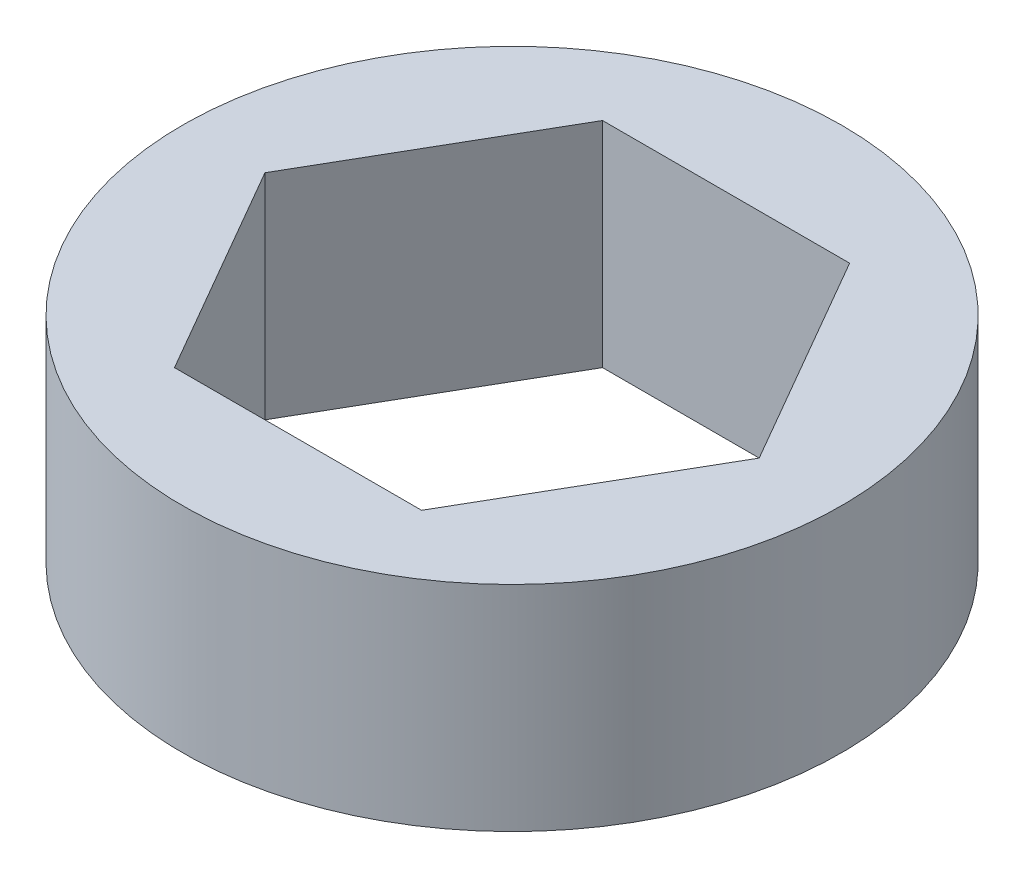
ISO-10303-21;
HEADER;
FILE_DESCRIPTION(('STEP AP214'),'2;1');
FILE_NAME('part.step','',(''),(''),'','','');
FILE_SCHEMA(('AUTOMOTIVE_DESIGN { 1 0 10303 214 1 1 1 1 }'));
ENDSEC;
DATA;
#1=APPLICATION_CONTEXT('core data for automotive mechanical design processes');
#2=APPLICATION_PROTOCOL_DEFINITION('international standard','automotive_design',2000,#1);
#3=PRODUCT_CONTEXT('',#1,'mechanical');
#4=PRODUCT('Part','Part','',(#3));
#5=PRODUCT_RELATED_PRODUCT_CATEGORY('part','',(#4));
#6=PRODUCT_DEFINITION_FORMATION('','',#4);
#7=PRODUCT_DEFINITION_CONTEXT('part definition',#1,'design');
#8=PRODUCT_DEFINITION('design','',#6,#7);
#9=PRODUCT_DEFINITION_SHAPE('','',#8);
#10=(LENGTH_UNIT() NAMED_UNIT(*) SI_UNIT(.MILLI.,.METRE.));
#11=(NAMED_UNIT(*) PLANE_ANGLE_UNIT() SI_UNIT($,.RADIAN.));
#12=(NAMED_UNIT(*) SI_UNIT($,.STERADIAN.) SOLID_ANGLE_UNIT());
#13=UNCERTAINTY_MEASURE_WITH_UNIT(LENGTH_MEASURE(1.E-05),#10,'distance_accuracy_value','');
#14=(GEOMETRIC_REPRESENTATION_CONTEXT(3) GLOBAL_UNCERTAINTY_ASSIGNED_CONTEXT((#13)) GLOBAL_UNIT_ASSIGNED_CONTEXT((#10,
#11,#12)) REPRESENTATION_CONTEXT('',''));
#15=CARTESIAN_POINT('',(0.,0.,0.));
#16=DIRECTION('',(0.,0.,1.));
#17=DIRECTION('',(1.,0.,0.));
#18=AXIS2_PLACEMENT_3D('',#15,#16,#17);
#19=CARTESIAN_POINT('',(0.,-3.175,0.));
#20=DIRECTION('',(0.,1.,0.));
#21=DIRECTION('',(0.,0.,1.));
#22=AXIS2_PLACEMENT_3D('',#19,#20,#21);
#23=CYLINDRICAL_SURFACE('',#22,9.779);
#24=CARTESIAN_POINT('',(0.,-3.175,0.));
#25=DIRECTION('',(0.,1.,0.));
#26=DIRECTION('',(0.,0.,-1.));
#27=AXIS2_PLACEMENT_3D('',#24,#25,#26);
#28=CIRCLE('',#27,9.779);
#29=CARTESIAN_POINT('',(0.,-3.175,-9.779));
#30=VERTEX_POINT('',#29);
#31=EDGE_CURVE('E11',#30,#30,#28,.T.);
#32=ORIENTED_EDGE('',*,*,#31,.T.);
#33=EDGE_LOOP('',(#32));
#34=FACE_BOUND('',#33,.T.);
#35=CARTESIAN_POINT('',(0.,3.175,0.));
#36=DIRECTION('',(0.,1.,0.));
#37=DIRECTION('',(0.,0.,-1.));
#38=AXIS2_PLACEMENT_3D('',#35,#36,#37);
#39=CIRCLE('',#38,9.779);
#40=CARTESIAN_POINT('',(0.,3.175,-9.779));
#41=VERTEX_POINT('',#40);
#42=EDGE_CURVE('E44',#41,#41,#39,.T.);
#43=ORIENTED_EDGE('',*,*,#42,.F.);
#44=EDGE_LOOP('',(#43));
#45=FACE_BOUND('',#44,.T.);
#46=ADVANCED_FACE('F41',(#34,#45),#23,.T.);
#47=CARTESIAN_POINT('',(0.,-3.175,0.));
#48=DIRECTION('',(0.,-1.,0.));
#49=DIRECTION('',(0.,0.,-1.));
#50=AXIS2_PLACEMENT_3D('',#47,#48,#49);
#51=PLANE('',#50);
#52=DIRECTION('',(-1.,0.,0.));
#53=VECTOR('',#52,1.);
#54=CARTESIAN_POINT('',(3.66617420935412,-3.175,-6.35));
#55=LINE('',#54,#53);
#56=CARTESIAN_POINT('',(3.66617420935412,-3.175,-6.35));
#57=VERTEX_POINT('',#56);
#58=CARTESIAN_POINT('',(-3.66617420935412,-3.175,-6.35));
#59=VERTEX_POINT('',#58);
#60=EDGE_CURVE('E95',#57,#59,#55,.T.);
#61=ORIENTED_EDGE('',*,*,#60,.T.);
#62=DIRECTION('',(-0.5,0.,0.866025403784439));
#63=VECTOR('',#62,1.);
#64=CARTESIAN_POINT('',(-3.66617420935412,-3.175,-6.35));
#65=LINE('',#64,#63);
#66=CARTESIAN_POINT('',(-7.33234841870825,-3.175,0.));
#67=VERTEX_POINT('',#66);
#68=EDGE_CURVE('E104',#59,#67,#65,.T.);
#69=ORIENTED_EDGE('',*,*,#68,.T.);
#70=DIRECTION('',(0.5,0.,0.866025403784439));
#71=VECTOR('',#70,1.);
#72=CARTESIAN_POINT('',(-7.33234841870825,-3.175,0.));
#73=LINE('',#72,#71);
#74=CARTESIAN_POINT('',(-3.66617420935412,-3.175,6.35));
#75=VERTEX_POINT('',#74);
#76=EDGE_CURVE('E55',#67,#75,#73,.T.);
#77=ORIENTED_EDGE('',*,*,#76,.T.);
#78=DIRECTION('',(1.,0.,0.));
#79=VECTOR('',#78,1.);
#80=CARTESIAN_POINT('',(-3.66617420935412,-3.175,6.35));
#81=LINE('',#80,#79);
#82=CARTESIAN_POINT('',(3.66617420935413,-3.175,6.35));
#83=VERTEX_POINT('',#82);
#84=EDGE_CURVE('E119',#75,#83,#81,.T.);
#85=ORIENTED_EDGE('',*,*,#84,.T.);
#86=DIRECTION('',(0.5,0.,-0.866025403784439));
#87=VECTOR('',#86,1.);
#88=CARTESIAN_POINT('',(3.66617420935413,-3.175,6.35));
#89=LINE('',#88,#87);
#90=CARTESIAN_POINT('',(7.33234841870825,-3.175,0.));
#91=VERTEX_POINT('',#90);
#92=EDGE_CURVE('E122',#83,#91,#89,.T.);
#93=ORIENTED_EDGE('',*,*,#92,.T.);
#94=DIRECTION('',(-0.5,0.,-0.866025403784438));
#95=VECTOR('',#94,1.);
#96=CARTESIAN_POINT('',(7.33234841870825,-3.175,0.));
#97=LINE('',#96,#95);
#98=EDGE_CURVE('E101',#91,#57,#97,.T.);
#99=ORIENTED_EDGE('',*,*,#98,.T.);
#100=EDGE_LOOP('',(#61,#69,#77,#85,#93,#99));
#101=FACE_BOUND('',#100,.T.);
#102=ORIENTED_EDGE('',*,*,#31,.F.);
#103=EDGE_LOOP('',(#102));
#104=FACE_BOUND('',#103,.T.);
#105=ADVANCED_FACE('F108',(#101,#104),#51,.T.);
#106=CARTESIAN_POINT('',(0.,3.175,0.));
#107=DIRECTION('',(0.,-1.,0.));
#108=DIRECTION('',(0.,0.,-1.));
#109=AXIS2_PLACEMENT_3D('',#106,#107,#108);
#110=PLANE('',#109);
#111=DIRECTION('',(-0.5,0.,0.866025403784439));
#112=VECTOR('',#111,1.);
#113=CARTESIAN_POINT('',(-3.66617420935412,3.175,-6.35));
#114=LINE('',#113,#112);
#115=CARTESIAN_POINT('',(-3.66617420935412,3.175,-6.35));
#116=VERTEX_POINT('',#115);
#117=CARTESIAN_POINT('',(-7.33234841870825,3.175,0.));
#118=VERTEX_POINT('',#117);
#119=EDGE_CURVE('E126',#116,#118,#114,.T.);
#120=ORIENTED_EDGE('',*,*,#119,.F.);
#121=DIRECTION('',(-1.,0.,0.));
#122=VECTOR('',#121,1.);
#123=CARTESIAN_POINT('',(3.66617420935412,3.175,-6.35));
#124=LINE('',#123,#122);
#125=CARTESIAN_POINT('',(3.66617420935412,3.175,-6.35));
#126=VERTEX_POINT('',#125);
#127=EDGE_CURVE('E63',#126,#116,#124,.T.);
#128=ORIENTED_EDGE('',*,*,#127,.F.);
#129=DIRECTION('',(-0.5,0.,-0.866025403784438));
#130=VECTOR('',#129,1.);
#131=CARTESIAN_POINT('',(7.33234841870825,3.175,0.));
#132=LINE('',#131,#130);
#133=CARTESIAN_POINT('',(7.33234841870825,3.175,0.));
#134=VERTEX_POINT('',#133);
#135=EDGE_CURVE('E112',#134,#126,#132,.T.);
#136=ORIENTED_EDGE('',*,*,#135,.F.);
#137=DIRECTION('',(0.5,0.,-0.866025403784439));
#138=VECTOR('',#137,1.);
#139=CARTESIAN_POINT('',(3.66617420935413,3.175,6.35));
#140=LINE('',#139,#138);
#141=CARTESIAN_POINT('',(3.66617420935413,3.175,6.35));
#142=VERTEX_POINT('',#141);
#143=EDGE_CURVE('E115',#142,#134,#140,.T.);
#144=ORIENTED_EDGE('',*,*,#143,.F.);
#145=DIRECTION('',(1.,0.,0.));
#146=VECTOR('',#145,1.);
#147=CARTESIAN_POINT('',(-3.66617420935412,3.175,6.35));
#148=LINE('',#147,#146);
#149=CARTESIAN_POINT('',(-3.66617420935412,3.175,6.35));
#150=VERTEX_POINT('',#149);
#151=EDGE_CURVE('E131',#150,#142,#148,.T.);
#152=ORIENTED_EDGE('',*,*,#151,.F.);
#153=DIRECTION('',(0.5,0.,0.866025403784439));
#154=VECTOR('',#153,1.);
#155=CARTESIAN_POINT('',(-7.33234841870825,3.175,0.));
#156=LINE('',#155,#154);
#157=EDGE_CURVE('E128',#118,#150,#156,.T.);
#158=ORIENTED_EDGE('',*,*,#157,.F.);
#159=EDGE_LOOP('',(#120,#128,#136,#144,#152,#158));
#160=FACE_BOUND('',#159,.T.);
#161=ORIENTED_EDGE('',*,*,#42,.T.);
#162=EDGE_LOOP('',(#161));
#163=FACE_BOUND('',#162,.T.);
#164=ADVANCED_FACE('F148',(#160,#163),#110,.F.);
#165=CARTESIAN_POINT('',(3.66617420935412,-3.175,-6.35));
#166=DIRECTION('',(0.,0.,-1.));
#167=DIRECTION('',(-1.,0.,0.));
#168=AXIS2_PLACEMENT_3D('',#165,#166,#167);
#169=PLANE('',#168);
#170=ORIENTED_EDGE('',*,*,#127,.T.);
#171=DIRECTION('',(0.,1.,0.));
#172=VECTOR('',#171,1.);
#173=CARTESIAN_POINT('',(-3.66617420935412,-3.175,-6.35));
#174=LINE('',#173,#172);
#175=EDGE_CURVE('E91',#59,#116,#174,.T.);
#176=ORIENTED_EDGE('',*,*,#175,.F.);
#177=ORIENTED_EDGE('',*,*,#60,.F.);
#178=DIRECTION('',(0.,1.,0.));
#179=VECTOR('',#178,1.);
#180=CARTESIAN_POINT('',(3.66617420935412,-3.175,-6.35));
#181=LINE('',#180,#179);
#182=EDGE_CURVE('E136',#57,#126,#181,.T.);
#183=ORIENTED_EDGE('',*,*,#182,.T.);
#184=EDGE_LOOP('',(#170,#176,#177,#183));
#185=FACE_BOUND('',#184,.T.);
#186=ADVANCED_FACE('F93',(#185),#169,.F.);
#187=CARTESIAN_POINT('',(7.33234841870825,-3.175,0.));
#188=DIRECTION('',(0.866025403784439,0.,-0.5));
#189=DIRECTION('',(-0.5,0.,-0.866025403784439));
#190=AXIS2_PLACEMENT_3D('',#187,#188,#189);
#191=PLANE('',#190);
#192=ORIENTED_EDGE('',*,*,#135,.T.);
#193=ORIENTED_EDGE('',*,*,#182,.F.);
#194=ORIENTED_EDGE('',*,*,#98,.F.);
#195=DIRECTION('',(0.,1.,0.));
#196=VECTOR('',#195,1.);
#197=CARTESIAN_POINT('',(7.33234841870825,-3.175,0.));
#198=LINE('',#197,#196);
#199=EDGE_CURVE('E138',#91,#134,#198,.T.);
#200=ORIENTED_EDGE('',*,*,#199,.T.);
#201=EDGE_LOOP('',(#192,#193,#194,#200));
#202=FACE_BOUND('',#201,.T.);
#203=ADVANCED_FACE('F159',(#202),#191,.F.);
#204=CARTESIAN_POINT('',(3.66617420935413,-3.175,6.35));
#205=DIRECTION('',(0.866025403784439,0.,0.5));
#206=DIRECTION('',(0.5,0.,-0.866025403784439));
#207=AXIS2_PLACEMENT_3D('',#204,#205,#206);
#208=PLANE('',#207);
#209=ORIENTED_EDGE('',*,*,#143,.T.);
#210=ORIENTED_EDGE('',*,*,#199,.F.);
#211=ORIENTED_EDGE('',*,*,#92,.F.);
#212=DIRECTION('',(0.,1.,0.));
#213=VECTOR('',#212,1.);
#214=CARTESIAN_POINT('',(3.66617420935413,-3.175,6.35));
#215=LINE('',#214,#213);
#216=EDGE_CURVE('E140',#83,#142,#215,.T.);
#217=ORIENTED_EDGE('',*,*,#216,.T.);
#218=EDGE_LOOP('',(#209,#210,#211,#217));
#219=FACE_BOUND('',#218,.T.);
#220=ADVANCED_FACE('F157',(#219),#208,.F.);
#221=CARTESIAN_POINT('',(-3.66617420935412,-3.175,6.35));
#222=DIRECTION('',(0.,0.,1.));
#223=DIRECTION('',(1.,0.,0.));
#224=AXIS2_PLACEMENT_3D('',#221,#222,#223);
#225=PLANE('',#224);
#226=ORIENTED_EDGE('',*,*,#151,.T.);
#227=ORIENTED_EDGE('',*,*,#216,.F.);
#228=ORIENTED_EDGE('',*,*,#84,.F.);
#229=DIRECTION('',(0.,1.,0.));
#230=VECTOR('',#229,1.);
#231=CARTESIAN_POINT('',(-3.66617420935412,-3.175,6.35));
#232=LINE('',#231,#230);
#233=EDGE_CURVE('E142',#75,#150,#232,.T.);
#234=ORIENTED_EDGE('',*,*,#233,.T.);
#235=EDGE_LOOP('',(#226,#227,#228,#234));
#236=FACE_BOUND('',#235,.T.);
#237=ADVANCED_FACE('F153',(#236),#225,.F.);
#238=CARTESIAN_POINT('',(-7.33234841870825,-3.175,0.));
#239=DIRECTION('',(-0.866025403784439,0.,0.5));
#240=DIRECTION('',(0.5,0.,0.866025403784439));
#241=AXIS2_PLACEMENT_3D('',#238,#239,#240);
#242=PLANE('',#241);
#243=ORIENTED_EDGE('',*,*,#157,.T.);
#244=ORIENTED_EDGE('',*,*,#233,.F.);
#245=ORIENTED_EDGE('',*,*,#76,.F.);
#246=DIRECTION('',(0.,1.,0.));
#247=VECTOR('',#246,1.);
#248=CARTESIAN_POINT('',(-7.33234841870825,-3.175,0.));
#249=LINE('',#248,#247);
#250=EDGE_CURVE('E100',#67,#118,#249,.T.);
#251=ORIENTED_EDGE('',*,*,#250,.T.);
#252=EDGE_LOOP('',(#243,#244,#245,#251));
#253=FACE_BOUND('',#252,.T.);
#254=ADVANCED_FACE('F144',(#253),#242,.F.);
#255=CARTESIAN_POINT('',(-3.66617420935412,-3.175,-6.35));
#256=DIRECTION('',(-0.866025403784438,0.,-0.5));
#257=DIRECTION('',(-0.5,0.,0.866025403784439));
#258=AXIS2_PLACEMENT_3D('',#255,#256,#257);
#259=PLANE('',#258);
#260=ORIENTED_EDGE('',*,*,#119,.T.);
#261=ORIENTED_EDGE('',*,*,#250,.F.);
#262=ORIENTED_EDGE('',*,*,#68,.F.);
#263=ORIENTED_EDGE('',*,*,#175,.T.);
#264=EDGE_LOOP('',(#260,#261,#262,#263));
#265=FACE_BOUND('',#264,.T.);
#266=ADVANCED_FACE('F105',(#265),#259,.F.);
#267=CLOSED_SHELL('',(#46,#105,#164,#186,#203,#220,#237,#254,#266));
#268=MANIFOLD_SOLID_BREP('B2',#267);
#269=ADVANCED_BREP_SHAPE_REPRESENTATION('',(#18,#268),#14);
#270=SHAPE_DEFINITION_REPRESENTATION(#9,#269);
ENDSEC;
END-ISO-10303-21;
